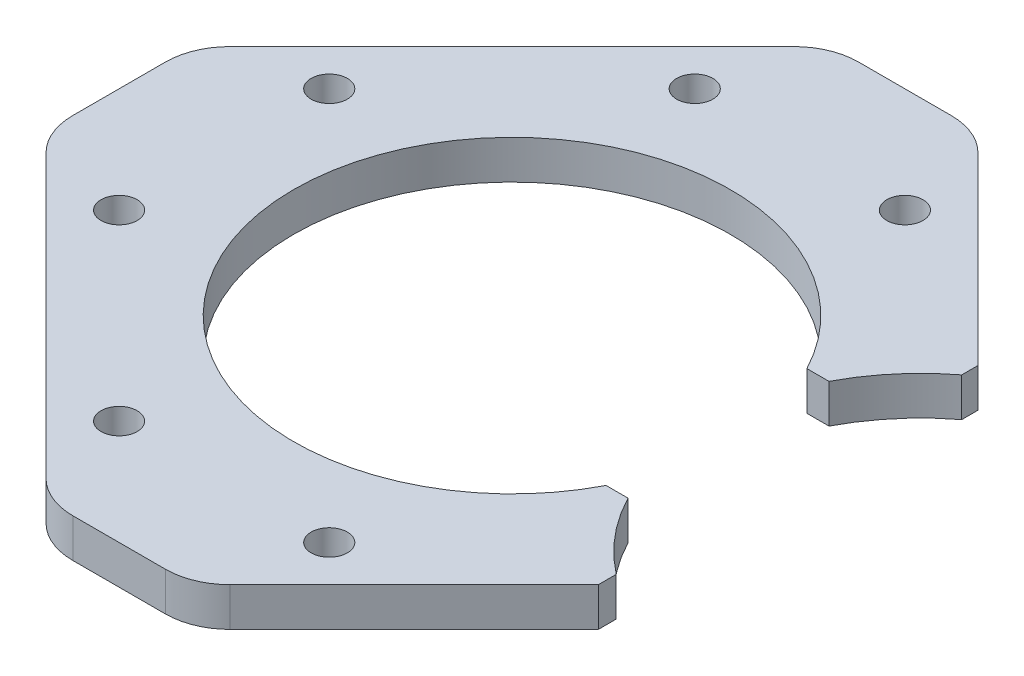
ISO-10303-21;
HEADER;
FILE_DESCRIPTION(('STEP AP214'),'2;1');
FILE_NAME('part.step','',(''),(''),'','','');
FILE_SCHEMA(('AUTOMOTIVE_DESIGN { 1 0 10303 214 1 1 1 1 }'));
ENDSEC;
DATA;
#1=APPLICATION_CONTEXT('core data for automotive mechanical design processes');
#2=APPLICATION_PROTOCOL_DEFINITION('international standard','automotive_design',2000,#1);
#3=PRODUCT_CONTEXT('',#1,'mechanical');
#4=PRODUCT('Part','Part','',(#3));
#5=PRODUCT_RELATED_PRODUCT_CATEGORY('part','',(#4));
#6=PRODUCT_DEFINITION_FORMATION('','',#4);
#7=PRODUCT_DEFINITION_CONTEXT('part definition',#1,'design');
#8=PRODUCT_DEFINITION('design','',#6,#7);
#9=PRODUCT_DEFINITION_SHAPE('','',#8);
#10=(LENGTH_UNIT() NAMED_UNIT(*) SI_UNIT(.MILLI.,.METRE.));
#11=(NAMED_UNIT(*) PLANE_ANGLE_UNIT() SI_UNIT($,.RADIAN.));
#12=(NAMED_UNIT(*) SI_UNIT($,.STERADIAN.) SOLID_ANGLE_UNIT());
#13=UNCERTAINTY_MEASURE_WITH_UNIT(LENGTH_MEASURE(1.E-05),#10,'distance_accuracy_value','');
#14=(GEOMETRIC_REPRESENTATION_CONTEXT(3) GLOBAL_UNCERTAINTY_ASSIGNED_CONTEXT((#13)) GLOBAL_UNIT_ASSIGNED_CONTEXT((#10,
#11,#12)) REPRESENTATION_CONTEXT('',''));
#15=CARTESIAN_POINT('',(0.,0.,0.));
#16=DIRECTION('',(0.,0.,1.));
#17=DIRECTION('',(1.,0.,0.));
#18=AXIS2_PLACEMENT_3D('',#15,#16,#17);
#19=CARTESIAN_POINT('',(36.,3.,0.));
#20=DIRECTION('',(0.,1.,0.));
#21=DIRECTION('',(0.,0.,1.));
#22=AXIS2_PLACEMENT_3D('',#19,#20,#21);
#23=PLANE('',#22);
#24=CARTESIAN_POINT('',(-3.76156065362437,3.,-22.2738636073764));
#25=DIRECTION('',(0.,1.,0.));
#26=DIRECTION('',(0.,0.,1.));
#27=AXIS2_PLACEMENT_3D('',#24,#25,#26);
#28=CIRCLE('',#27,1.4);
#29=CARTESIAN_POINT('',(-3.76156065362437,3.,-20.8738636073764));
#30=VERTEX_POINT('',#29);
#31=EDGE_CURVE('E488',#30,#30,#28,.T.);
#32=ORIENTED_EDGE('',*,*,#31,.F.);
#33=EDGE_LOOP('',(#32));
#34=FACE_BOUND('',#33,.T.);
#35=CARTESIAN_POINT('',(-17.9036962773556,3.,8.13172798364494));
#36=DIRECTION('',(0.,1.,0.));
#37=DIRECTION('',(0.,0.,1.));
#38=AXIS2_PLACEMENT_3D('',#35,#36,#37);
#39=CIRCLE('',#38,1.4);
#40=CARTESIAN_POINT('',(-17.9036962773556,3.,9.53172798364494));
#41=VERTEX_POINT('',#40);
#42=EDGE_CURVE('E243',#41,#41,#39,.T.);
#43=ORIENTED_EDGE('',*,*,#42,.F.);
#44=EDGE_LOOP('',(#43));
#45=FACE_BOUND('',#44,.T.);
#46=CARTESIAN_POINT('',(12.5018953136657,3.,22.2738636073764));
#47=DIRECTION('',(0.,1.,0.));
#48=DIRECTION('',(0.,0.,1.));
#49=AXIS2_PLACEMENT_3D('',#46,#47,#48);
#50=CIRCLE('',#49,1.4);
#51=CARTESIAN_POINT('',(12.5018953136657,3.,23.6738636073764));
#52=VERTEX_POINT('',#51);
#53=EDGE_CURVE('E244',#52,#52,#50,.T.);
#54=ORIENTED_EDGE('',*,*,#53,.F.);
#55=EDGE_LOOP('',(#54));
#56=FACE_BOUND('',#55,.T.);
#57=CARTESIAN_POINT('',(36.,3.,0.));
#58=DIRECTION('',(0.,-1.,0.));
#59=DIRECTION('',(0.,0.,1.));
#60=AXIS2_PLACEMENT_3D('',#57,#58,#59);
#61=CIRCLE('',#60,16.9);
#62=CARTESIAN_POINT('',(21.0390641269301,3.,-7.86005075059257));
#63=VERTEX_POINT('',#62);
#64=CARTESIAN_POINT('',(25.7425310421869,3.,-13.4310956581919));
#65=VERTEX_POINT('',#64);
#66=EDGE_CURVE('E258',#63,#65,#61,.T.);
#67=ORIENTED_EDGE('',*,*,#66,.T.);
#68=DIRECTION('',(0.,0.,-1.));
#69=VECTOR('',#68,1.);
#70=CARTESIAN_POINT('',(25.7425310421869,3.,-14.6900821283476));
#71=LINE('',#70,#69);
#72=CARTESIAN_POINT('',(25.7425310421869,3.,-14.6900821283476));
#73=VERTEX_POINT('',#72);
#74=EDGE_CURVE('E143',#65,#73,#71,.T.);
#75=ORIENTED_EDGE('',*,*,#74,.T.);
#76=DIRECTION('',(-0.707106781186536,0.,-0.707106781186559));
#77=VECTOR('',#76,1.);
#78=CARTESIAN_POINT('',(25.7425310421869,3.,-14.6900821283476));
#79=LINE('',#78,#77);
#80=CARTESIAN_POINT('',(11.4914876735808,3.,-28.9411254969542));
#81=VERTEX_POINT('',#80);
#82=EDGE_CURVE('E264',#73,#81,#79,.T.);
#83=ORIENTED_EDGE('',*,*,#82,.T.);
#84=CARTESIAN_POINT('',(7.95595376764797,3.,-25.4055915910215));
#85=DIRECTION('',(0.,1.,0.));
#86=DIRECTION('',(0.,0.,1.));
#87=AXIS2_PLACEMENT_3D('',#84,#85,#86);
#88=CIRCLE('',#87,5.00000000000002);
#89=CARTESIAN_POINT('',(7.95595376764804,3.,-30.4055915910215));
#90=VERTEX_POINT('',#89);
#91=EDGE_CURVE('E268',#81,#90,#88,.T.);
#92=ORIENTED_EDGE('',*,*,#91,.T.);
#93=DIRECTION('',(-1.,0.,0.));
#94=VECTOR('',#93,1.);
#95=CARTESIAN_POINT('',(7.95595376764804,3.,-30.4055915910214));
#96=LINE('',#95,#94);
#97=CARTESIAN_POINT('',(0.784380892394076,3.,-30.4055915910215));
#98=VERTEX_POINT('',#97);
#99=EDGE_CURVE('E276',#90,#98,#96,.T.);
#100=ORIENTED_EDGE('',*,*,#99,.T.);
#101=CARTESIAN_POINT('',(0.784380892394016,3.,-25.4055915910216));
#102=DIRECTION('',(0.,1.,0.));
#103=DIRECTION('',(0.,0.,1.));
#104=AXIS2_PLACEMENT_3D('',#101,#102,#103);
#105=CIRCLE('',#104,5.00000000000002);
#106=CARTESIAN_POINT('',(-2.75115301353867,3.,-28.9411254969544));
#107=VERTEX_POINT('',#106);
#108=EDGE_CURVE('E279',#98,#107,#105,.T.);
#109=ORIENTED_EDGE('',*,*,#108,.T.);
#110=DIRECTION('',(-0.707106781186548,0.,0.707106781186548));
#111=VECTOR('',#110,1.);
#112=CARTESIAN_POINT('',(-2.75115301353868,3.,-28.9411254969544));
#113=LINE('',#112,#111);
#114=CARTESIAN_POINT('',(-24.5709581669333,3.,-7.12132034355974));
#115=VERTEX_POINT('',#114);
#116=EDGE_CURVE('E283',#107,#115,#113,.T.);
#117=ORIENTED_EDGE('',*,*,#116,.T.);
#118=CARTESIAN_POINT('',(-21.0354242610009,3.,-3.58578643762727));
#119=DIRECTION('',(0.,1.,0.));
#120=DIRECTION('',(0.,0.,1.));
#121=AXIS2_PLACEMENT_3D('',#118,#119,#120);
#122=CIRCLE('',#121,4.99999999999981);
#123=CARTESIAN_POINT('',(-26.0354242610007,3.,-3.58578643762734));
#124=VERTEX_POINT('',#123);
#125=EDGE_CURVE('E287',#115,#124,#122,.T.);
#126=ORIENTED_EDGE('',*,*,#125,.T.);
#127=DIRECTION('',(0.,0.,1.));
#128=VECTOR('',#127,1.);
#129=CARTESIAN_POINT('',(-26.0354242610009,3.,-3.58578643762734));
#130=LINE('',#129,#128);
#131=CARTESIAN_POINT('',(-26.035424261001,3.,3.58578643762645));
#132=VERTEX_POINT('',#131);
#133=EDGE_CURVE('E295',#124,#132,#130,.T.);
#134=ORIENTED_EDGE('',*,*,#133,.T.);
#135=CARTESIAN_POINT('',(-21.035424261001,3.,3.58578643762653));
#136=DIRECTION('',(0.,1.,0.));
#137=DIRECTION('',(0.,0.,1.));
#138=AXIS2_PLACEMENT_3D('',#135,#136,#137);
#139=CIRCLE('',#138,4.99999999999998);
#140=CARTESIAN_POINT('',(-24.5709581669337,3.,7.12132034355923));
#141=VERTEX_POINT('',#140);
#142=EDGE_CURVE('E298',#132,#141,#139,.T.);
#143=ORIENTED_EDGE('',*,*,#142,.T.);
#144=DIRECTION('',(0.707106781186548,0.,0.707106781186547));
#145=VECTOR('',#144,1.);
#146=CARTESIAN_POINT('',(-24.5709581669337,3.,7.12132034355921));
#147=LINE('',#146,#145);
#148=CARTESIAN_POINT('',(-2.75115301353892,3.,28.941125496954));
#149=VERTEX_POINT('',#148);
#150=EDGE_CURVE('E302',#141,#149,#147,.T.);
#151=ORIENTED_EDGE('',*,*,#150,.T.);
#152=CARTESIAN_POINT('',(0.784380892393515,3.,25.4055915910216));
#153=DIRECTION('',(0.,1.,0.));
#154=DIRECTION('',(0.,0.,1.));
#155=AXIS2_PLACEMENT_3D('',#152,#153,#154);
#156=CIRCLE('',#155,4.99999999999979);
#157=CARTESIAN_POINT('',(0.784380892393515,3.,30.4055915910213));
#158=VERTEX_POINT('',#157);
#159=EDGE_CURVE('E306',#149,#158,#156,.T.);
#160=ORIENTED_EDGE('',*,*,#159,.T.);
#161=DIRECTION('',(1.,0.,0.));
#162=VECTOR('',#161,1.);
#163=CARTESIAN_POINT('',(0.784380892393435,3.,30.4055915910215));
#164=LINE('',#163,#162);
#165=CARTESIAN_POINT('',(7.95595376764716,3.,30.4055915910215));
#166=VERTEX_POINT('',#165);
#167=EDGE_CURVE('E314',#158,#166,#164,.T.);
#168=ORIENTED_EDGE('',*,*,#167,.T.);
#169=CARTESIAN_POINT('',(7.95595376764724,3.,25.4055915910216));
#170=DIRECTION('',(0.,1.,0.));
#171=DIRECTION('',(0.,0.,1.));
#172=AXIS2_PLACEMENT_3D('',#169,#170,#171);
#173=CIRCLE('',#172,5.00000000000002);
#174=CARTESIAN_POINT('',(11.4914876735799,3.,28.9411254969544));
#175=VERTEX_POINT('',#174);
#176=EDGE_CURVE('E317',#166,#175,#173,.T.);
#177=ORIENTED_EDGE('',*,*,#176,.T.);
#178=DIRECTION('',(0.707106781186557,0.,-0.707106781186538));
#179=VECTOR('',#178,1.);
#180=CARTESIAN_POINT('',(11.4914876735799,3.,28.9411254969544));
#181=LINE('',#180,#179);
#182=CARTESIAN_POINT('',(25.7425310421871,3.,14.6900821283476));
#183=VERTEX_POINT('',#182);
#184=EDGE_CURVE('E321',#175,#183,#181,.T.);
#185=ORIENTED_EDGE('',*,*,#184,.T.);
#186=DIRECTION('',(-1.30257714467279E-13,0.,-1.));
#187=VECTOR('',#186,1.);
#188=CARTESIAN_POINT('',(25.7425310421871,3.,14.6900821283476));
#189=LINE('',#188,#187);
#190=CARTESIAN_POINT('',(25.7425310421869,3.,13.3050490634007));
#191=VERTEX_POINT('',#190);
#192=EDGE_CURVE('E325',#183,#191,#189,.T.);
#193=ORIENTED_EDGE('',*,*,#192,.T.);
#194=CARTESIAN_POINT('',(36.,3.,0.));
#195=DIRECTION('',(0.,-1.,0.));
#196=DIRECTION('',(0.,0.,1.));
#197=AXIS2_PLACEMENT_3D('',#194,#195,#196);
#198=CIRCLE('',#197,16.8);
#199=CARTESIAN_POINT('',(21.0903668558269,3.,7.74227611921559));
#200=VERTEX_POINT('',#199);
#201=EDGE_CURVE('E198',#191,#200,#198,.T.);
#202=ORIENTED_EDGE('',*,*,#201,.T.);
#203=DIRECTION('',(-1.,0.,0.));
#204=VECTOR('',#203,1.);
#205=CARTESIAN_POINT('',(19.3923895522432,3.,7.74227611921559));
#206=LINE('',#205,#204);
#207=CARTESIAN_POINT('',(19.3923895522432,3.,7.74227611921559));
#208=VERTEX_POINT('',#207);
#209=EDGE_CURVE('E192',#200,#208,#206,.T.);
#210=ORIENTED_EDGE('',*,*,#209,.T.);
#211=CARTESIAN_POINT('',(4.37016733002108,3.,0.));
#212=DIRECTION('',(0.,-1.,0.));
#213=DIRECTION('',(0.,0.,1.));
#214=AXIS2_PLACEMENT_3D('',#211,#212,#213);
#215=CIRCLE('',#214,16.9);
#216=CARTESIAN_POINT('',(19.331103203091,3.,-7.86005075059257));
#217=VERTEX_POINT('',#216);
#218=EDGE_CURVE('E196',#208,#217,#215,.T.);
#219=ORIENTED_EDGE('',*,*,#218,.T.);
#220=DIRECTION('',(1.,0.,0.));
#221=VECTOR('',#220,1.);
#222=CARTESIAN_POINT('',(19.331103203091,3.,-7.86005075059257));
#223=LINE('',#222,#221);
#224=EDGE_CURVE('E64',#217,#63,#223,.T.);
#225=ORIENTED_EDGE('',*,*,#224,.T.);
#226=EDGE_LOOP('',(#67,#75,#83,#92,#100,#109,#117,#126,#134,#143,#151,#160,#168,#177,#185,#193,
#202,#210,#219,#225));
#227=FACE_BOUND('',#226,.T.);
#228=CARTESIAN_POINT('',(-3.7615606536249,3.,22.2738636073761));
#229=DIRECTION('',(0.,1.,0.));
#230=DIRECTION('',(0.,0.,1.));
#231=AXIS2_PLACEMENT_3D('',#228,#229,#230);
#232=CIRCLE('',#231,1.4);
#233=CARTESIAN_POINT('',(-3.7615606536249,3.,23.6738636073761));
#234=VERTEX_POINT('',#233);
#235=EDGE_CURVE('E230',#234,#234,#232,.T.);
#236=ORIENTED_EDGE('',*,*,#235,.F.);
#237=EDGE_LOOP('',(#236));
#238=FACE_BOUND('',#237,.T.);
#239=CARTESIAN_POINT('',(-17.9036962773555,3.,-8.1317279836456));
#240=DIRECTION('',(0.,1.,0.));
#241=DIRECTION('',(0.,0.,1.));
#242=AXIS2_PLACEMENT_3D('',#239,#240,#241);
#243=CIRCLE('',#242,1.4);
#244=CARTESIAN_POINT('',(-17.9036962773555,3.,-6.73172798364561));
#245=VERTEX_POINT('',#244);
#246=EDGE_CURVE('E482',#245,#245,#243,.T.);
#247=ORIENTED_EDGE('',*,*,#246,.F.);
#248=EDGE_LOOP('',(#247));
#249=FACE_BOUND('',#248,.T.);
#250=CARTESIAN_POINT('',(12.5018953136662,3.,-22.273863607376));
#251=DIRECTION('',(0.,1.,0.));
#252=DIRECTION('',(0.,0.,1.));
#253=AXIS2_PLACEMENT_3D('',#250,#251,#252);
#254=CIRCLE('',#253,1.4);
#255=CARTESIAN_POINT('',(12.5018953136662,3.,-20.873863607376));
#256=VERTEX_POINT('',#255);
#257=EDGE_CURVE('E496',#256,#256,#254,.T.);
#258=ORIENTED_EDGE('',*,*,#257,.F.);
#259=EDGE_LOOP('',(#258));
#260=FACE_BOUND('',#259,.T.);
#261=ADVANCED_FACE('F46',(#34,#45,#56,#227,#238,#249,#260),#23,.T.);
#262=CARTESIAN_POINT('',(36.,0.,0.));
#263=DIRECTION('',(0.,1.,0.));
#264=DIRECTION('',(0.,0.,1.));
#265=AXIS2_PLACEMENT_3D('',#262,#263,#264);
#266=PLANE('',#265);
#267=CARTESIAN_POINT('',(36.,0.,0.));
#268=DIRECTION('',(0.,-1.,0.));
#269=DIRECTION('',(0.,0.,1.));
#270=AXIS2_PLACEMENT_3D('',#267,#268,#269);
#271=CIRCLE('',#270,16.9);
#272=CARTESIAN_POINT('',(21.0390641269301,0.,-7.86005075059257));
#273=VERTEX_POINT('',#272);
#274=CARTESIAN_POINT('',(25.7425310421869,0.,-13.4310956581919));
#275=VERTEX_POINT('',#274);
#276=EDGE_CURVE('E249',#273,#275,#271,.T.);
#277=ORIENTED_EDGE('',*,*,#276,.F.);
#278=DIRECTION('',(1.,0.,0.));
#279=VECTOR('',#278,1.);
#280=CARTESIAN_POINT('',(19.331103203091,0.,-7.86005075059257));
#281=LINE('',#280,#279);
#282=CARTESIAN_POINT('',(19.331103203091,0.,-7.86005075059257));
#283=VERTEX_POINT('',#282);
#284=EDGE_CURVE('E135',#283,#273,#281,.T.);
#285=ORIENTED_EDGE('',*,*,#284,.F.);
#286=CARTESIAN_POINT('',(4.37016733002108,0.,0.));
#287=DIRECTION('',(0.,-1.,0.));
#288=DIRECTION('',(0.,0.,1.));
#289=AXIS2_PLACEMENT_3D('',#286,#287,#288);
#290=CIRCLE('',#289,16.9);
#291=CARTESIAN_POINT('',(19.3923895522432,0.,7.74227611921559));
#292=VERTEX_POINT('',#291);
#293=EDGE_CURVE('E129',#292,#283,#290,.T.);
#294=ORIENTED_EDGE('',*,*,#293,.F.);
#295=DIRECTION('',(-1.,0.,0.));
#296=VECTOR('',#295,1.);
#297=CARTESIAN_POINT('',(19.3923895522432,0.,7.74227611921559));
#298=LINE('',#297,#296);
#299=CARTESIAN_POINT('',(21.0903668558269,0.,7.74227611921559));
#300=VERTEX_POINT('',#299);
#301=EDGE_CURVE('E207',#300,#292,#298,.T.);
#302=ORIENTED_EDGE('',*,*,#301,.F.);
#303=CARTESIAN_POINT('',(36.,0.,0.));
#304=DIRECTION('',(0.,-1.,0.));
#305=DIRECTION('',(0.,0.,1.));
#306=AXIS2_PLACEMENT_3D('',#303,#304,#305);
#307=CIRCLE('',#306,16.8);
#308=CARTESIAN_POINT('',(25.7425310421869,0.,13.3050490634007));
#309=VERTEX_POINT('',#308);
#310=EDGE_CURVE('E348',#309,#300,#307,.T.);
#311=ORIENTED_EDGE('',*,*,#310,.F.);
#312=DIRECTION('',(-1.30257714467279E-13,0.,-1.));
#313=VECTOR('',#312,1.);
#314=CARTESIAN_POINT('',(25.7425310421871,0.,14.6900821283476));
#315=LINE('',#314,#313);
#316=CARTESIAN_POINT('',(25.7425310421871,0.,14.6900821283476));
#317=VERTEX_POINT('',#316);
#318=EDGE_CURVE('E341',#317,#309,#315,.T.);
#319=ORIENTED_EDGE('',*,*,#318,.F.);
#320=DIRECTION('',(0.707106781186557,0.,-0.707106781186538));
#321=VECTOR('',#320,1.);
#322=CARTESIAN_POINT('',(11.4914876735799,0.,28.9411254969544));
#323=LINE('',#322,#321);
#324=CARTESIAN_POINT('',(11.4914876735799,0.,28.9411254969544));
#325=VERTEX_POINT('',#324);
#326=EDGE_CURVE('E455',#325,#317,#323,.T.);
#327=ORIENTED_EDGE('',*,*,#326,.F.);
#328=CARTESIAN_POINT('',(7.95595376764724,0.,25.4055915910216));
#329=DIRECTION('',(0.,1.,0.));
#330=DIRECTION('',(0.,0.,1.));
#331=AXIS2_PLACEMENT_3D('',#328,#329,#330);
#332=CIRCLE('',#331,5.00000000000002);
#333=CARTESIAN_POINT('',(7.95595376764716,0.,30.4055915910215));
#334=VERTEX_POINT('',#333);
#335=EDGE_CURVE('E452',#334,#325,#332,.T.);
#336=ORIENTED_EDGE('',*,*,#335,.F.);
#337=DIRECTION('',(1.,0.,0.));
#338=VECTOR('',#337,1.);
#339=CARTESIAN_POINT('',(0.784380892393435,0.,30.4055915910215));
#340=LINE('',#339,#338);
#341=CARTESIAN_POINT('',(0.784380892393515,0.,30.4055915910213));
#342=VERTEX_POINT('',#341);
#343=EDGE_CURVE('E449',#342,#334,#340,.T.);
#344=ORIENTED_EDGE('',*,*,#343,.F.);
#345=CARTESIAN_POINT('',(0.784380892393515,0.,25.4055915910216));
#346=DIRECTION('',(0.,1.,0.));
#347=DIRECTION('',(0.,0.,1.));
#348=AXIS2_PLACEMENT_3D('',#345,#346,#347);
#349=CIRCLE('',#348,4.99999999999979);
#350=CARTESIAN_POINT('',(-2.75115301353892,0.,28.941125496954));
#351=VERTEX_POINT('',#350);
#352=EDGE_CURVE('E446',#351,#342,#349,.T.);
#353=ORIENTED_EDGE('',*,*,#352,.F.);
#354=DIRECTION('',(0.707106781186548,0.,0.707106781186547));
#355=VECTOR('',#354,1.);
#356=CARTESIAN_POINT('',(-24.5709581669337,0.,7.12132034355921));
#357=LINE('',#356,#355);
#358=CARTESIAN_POINT('',(-24.5709581669337,0.,7.12132034355923));
#359=VERTEX_POINT('',#358);
#360=EDGE_CURVE('E443',#359,#351,#357,.T.);
#361=ORIENTED_EDGE('',*,*,#360,.F.);
#362=CARTESIAN_POINT('',(-21.035424261001,0.,3.58578643762653));
#363=DIRECTION('',(0.,1.,0.));
#364=DIRECTION('',(0.,0.,1.));
#365=AXIS2_PLACEMENT_3D('',#362,#363,#364);
#366=CIRCLE('',#365,4.99999999999998);
#367=CARTESIAN_POINT('',(-26.035424261001,0.,3.58578643762645));
#368=VERTEX_POINT('',#367);
#369=EDGE_CURVE('E440',#368,#359,#366,.T.);
#370=ORIENTED_EDGE('',*,*,#369,.F.);
#371=DIRECTION('',(0.,0.,1.));
#372=VECTOR('',#371,1.);
#373=CARTESIAN_POINT('',(-26.0354242610009,0.,-3.58578643762734));
#374=LINE('',#373,#372);
#375=CARTESIAN_POINT('',(-26.0354242610007,0.,-3.58578643762734));
#376=VERTEX_POINT('',#375);
#377=EDGE_CURVE('E437',#376,#368,#374,.T.);
#378=ORIENTED_EDGE('',*,*,#377,.F.);
#379=CARTESIAN_POINT('',(-21.0354242610009,0.,-3.58578643762727));
#380=DIRECTION('',(0.,1.,0.));
#381=DIRECTION('',(0.,0.,1.));
#382=AXIS2_PLACEMENT_3D('',#379,#380,#381);
#383=CIRCLE('',#382,4.99999999999981);
#384=CARTESIAN_POINT('',(-24.5709581669333,0.,-7.12132034355974));
#385=VERTEX_POINT('',#384);
#386=EDGE_CURVE('E434',#385,#376,#383,.T.);
#387=ORIENTED_EDGE('',*,*,#386,.F.);
#388=DIRECTION('',(-0.707106781186548,0.,0.707106781186548));
#389=VECTOR('',#388,1.);
#390=CARTESIAN_POINT('',(-2.75115301353868,0.,-28.9411254969544));
#391=LINE('',#390,#389);
#392=CARTESIAN_POINT('',(-2.75115301353867,0.,-28.9411254969544));
#393=VERTEX_POINT('',#392);
#394=EDGE_CURVE('E431',#393,#385,#391,.T.);
#395=ORIENTED_EDGE('',*,*,#394,.F.);
#396=CARTESIAN_POINT('',(0.784380892394016,0.,-25.4055915910216));
#397=DIRECTION('',(0.,1.,0.));
#398=DIRECTION('',(0.,0.,1.));
#399=AXIS2_PLACEMENT_3D('',#396,#397,#398);
#400=CIRCLE('',#399,5.00000000000002);
#401=CARTESIAN_POINT('',(0.784380892394076,0.,-30.4055915910215));
#402=VERTEX_POINT('',#401);
#403=EDGE_CURVE('E428',#402,#393,#400,.T.);
#404=ORIENTED_EDGE('',*,*,#403,.F.);
#405=DIRECTION('',(-1.,0.,0.));
#406=VECTOR('',#405,1.);
#407=CARTESIAN_POINT('',(7.95595376764804,0.,-30.4055915910214));
#408=LINE('',#407,#406);
#409=CARTESIAN_POINT('',(7.95595376764804,0.,-30.4055915910215));
#410=VERTEX_POINT('',#409);
#411=EDGE_CURVE('E422',#410,#402,#408,.T.);
#412=ORIENTED_EDGE('',*,*,#411,.F.);
#413=CARTESIAN_POINT('',(7.95595376764797,0.,-25.4055915910215));
#414=DIRECTION('',(0.,1.,0.));
#415=DIRECTION('',(0.,0.,1.));
#416=AXIS2_PLACEMENT_3D('',#413,#414,#415);
#417=CIRCLE('',#416,5.00000000000002);
#418=CARTESIAN_POINT('',(11.4914876735808,0.,-28.9411254969542));
#419=VERTEX_POINT('',#418);
#420=EDGE_CURVE('E417',#419,#410,#417,.T.);
#421=ORIENTED_EDGE('',*,*,#420,.F.);
#422=DIRECTION('',(-0.707106781186536,0.,-0.707106781186559));
#423=VECTOR('',#422,1.);
#424=CARTESIAN_POINT('',(25.7425310421869,0.,-14.6900821283476));
#425=LINE('',#424,#423);
#426=CARTESIAN_POINT('',(25.7425310421869,0.,-14.6900821283476));
#427=VERTEX_POINT('',#426);
#428=EDGE_CURVE('E409',#427,#419,#425,.T.);
#429=ORIENTED_EDGE('',*,*,#428,.F.);
#430=DIRECTION('',(0.,0.,-1.));
#431=VECTOR('',#430,1.);
#432=CARTESIAN_POINT('',(25.7425310421869,0.,-14.6900821283476));
#433=LINE('',#432,#431);
#434=EDGE_CURVE('E415',#275,#427,#433,.T.);
#435=ORIENTED_EDGE('',*,*,#434,.F.);
#436=EDGE_LOOP('',(#277,#285,#294,#302,#311,#319,#327,#336,#344,#353,#361,#370,#378,#387,#395,
#404,#412,#421,#429,#435));
#437=FACE_BOUND('',#436,.T.);
#438=CARTESIAN_POINT('',(12.5018953136657,0.,22.2738636073764));
#439=DIRECTION('',(0.,1.,0.));
#440=DIRECTION('',(0.,0.,1.));
#441=AXIS2_PLACEMENT_3D('',#438,#439,#440);
#442=CIRCLE('',#441,1.4);
#443=CARTESIAN_POINT('',(12.5018953136657,0.,23.6738636073764));
#444=VERTEX_POINT('',#443);
#445=EDGE_CURVE('E236',#444,#444,#442,.T.);
#446=ORIENTED_EDGE('',*,*,#445,.T.);
#447=EDGE_LOOP('',(#446));
#448=FACE_BOUND('',#447,.T.);
#449=CARTESIAN_POINT('',(-3.7615606536249,0.,22.2738636073761));
#450=DIRECTION('',(0.,1.,0.));
#451=DIRECTION('',(0.,0.,1.));
#452=AXIS2_PLACEMENT_3D('',#449,#450,#451);
#453=CIRCLE('',#452,1.4);
#454=CARTESIAN_POINT('',(-3.7615606536249,0.,23.6738636073761));
#455=VERTEX_POINT('',#454);
#456=EDGE_CURVE('E237',#455,#455,#453,.T.);
#457=ORIENTED_EDGE('',*,*,#456,.T.);
#458=EDGE_LOOP('',(#457));
#459=FACE_BOUND('',#458,.T.);
#460=CARTESIAN_POINT('',(-17.9036962773556,0.,8.13172798364494));
#461=DIRECTION('',(0.,1.,0.));
#462=DIRECTION('',(0.,0.,1.));
#463=AXIS2_PLACEMENT_3D('',#460,#461,#462);
#464=CIRCLE('',#463,1.4);
#465=CARTESIAN_POINT('',(-17.9036962773556,0.,9.53172798364494));
#466=VERTEX_POINT('',#465);
#467=EDGE_CURVE('E238',#466,#466,#464,.T.);
#468=ORIENTED_EDGE('',*,*,#467,.T.);
#469=EDGE_LOOP('',(#468));
#470=FACE_BOUND('',#469,.T.);
#471=CARTESIAN_POINT('',(-17.9036962773555,0.,-8.1317279836456));
#472=DIRECTION('',(0.,1.,0.));
#473=DIRECTION('',(0.,0.,1.));
#474=AXIS2_PLACEMENT_3D('',#471,#472,#473);
#475=CIRCLE('',#474,1.4);
#476=CARTESIAN_POINT('',(-17.9036962773555,0.,-6.73172798364561));
#477=VERTEX_POINT('',#476);
#478=EDGE_CURVE('E485',#477,#477,#475,.T.);
#479=ORIENTED_EDGE('',*,*,#478,.T.);
#480=EDGE_LOOP('',(#479));
#481=FACE_BOUND('',#480,.T.);
#482=CARTESIAN_POINT('',(-3.76156065362437,0.,-22.2738636073764));
#483=DIRECTION('',(0.,1.,0.));
#484=DIRECTION('',(0.,0.,1.));
#485=AXIS2_PLACEMENT_3D('',#482,#483,#484);
#486=CIRCLE('',#485,1.4);
#487=CARTESIAN_POINT('',(-3.76156065362437,0.,-20.8738636073764));
#488=VERTEX_POINT('',#487);
#489=EDGE_CURVE('E492',#488,#488,#486,.T.);
#490=ORIENTED_EDGE('',*,*,#489,.T.);
#491=EDGE_LOOP('',(#490));
#492=FACE_BOUND('',#491,.T.);
#493=CARTESIAN_POINT('',(12.5018953136662,0.,-22.273863607376));
#494=DIRECTION('',(0.,1.,0.));
#495=DIRECTION('',(0.,0.,1.));
#496=AXIS2_PLACEMENT_3D('',#493,#494,#495);
#497=CIRCLE('',#496,1.4);
#498=CARTESIAN_POINT('',(12.5018953136662,0.,-20.873863607376));
#499=VERTEX_POINT('',#498);
#500=EDGE_CURVE('E500',#499,#499,#497,.T.);
#501=ORIENTED_EDGE('',*,*,#500,.T.);
#502=EDGE_LOOP('',(#501));
#503=FACE_BOUND('',#502,.T.);
#504=ADVANCED_FACE('F413',(#437,#448,#459,#470,#481,#492,#503),#266,.F.);
#505=CARTESIAN_POINT('',(36.,3.,0.));
#506=DIRECTION('',(0.,-1.,0.));
#507=DIRECTION('',(0.,0.,-1.));
#508=AXIS2_PLACEMENT_3D('',#505,#506,#507);
#509=CYLINDRICAL_SURFACE('',#508,16.9);
#510=ORIENTED_EDGE('',*,*,#276,.T.);
#511=DIRECTION('',(0.,-1.,0.));
#512=VECTOR('',#511,1.);
#513=CARTESIAN_POINT('',(25.7425310421869,3.,-13.4310956581919));
#514=LINE('',#513,#512);
#515=EDGE_CURVE('E12',#65,#275,#514,.T.);
#516=ORIENTED_EDGE('',*,*,#515,.F.);
#517=ORIENTED_EDGE('',*,*,#66,.F.);
#518=DIRECTION('',(0.,-1.,0.));
#519=VECTOR('',#518,1.);
#520=CARTESIAN_POINT('',(21.0390641269301,3.,-7.86005075059257));
#521=LINE('',#520,#519);
#522=EDGE_CURVE('E216',#63,#273,#521,.T.);
#523=ORIENTED_EDGE('',*,*,#522,.T.);
#524=EDGE_LOOP('',(#510,#516,#517,#523));
#525=FACE_BOUND('',#524,.T.);
#526=ADVANCED_FACE('F48',(#525),#509,.F.);
#527=CARTESIAN_POINT('',(25.7425310421869,3.,-14.6900821283476));
#528=DIRECTION('',(-1.,0.,0.));
#529=DIRECTION('',(0.,0.,1.));
#530=AXIS2_PLACEMENT_3D('',#527,#528,#529);
#531=PLANE('',#530);
#532=ORIENTED_EDGE('',*,*,#434,.T.);
#533=DIRECTION('',(0.,-1.,0.));
#534=VECTOR('',#533,1.);
#535=CARTESIAN_POINT('',(25.7425310421869,3.,-14.6900821283476));
#536=LINE('',#535,#534);
#537=EDGE_CURVE('E56',#73,#427,#536,.T.);
#538=ORIENTED_EDGE('',*,*,#537,.F.);
#539=ORIENTED_EDGE('',*,*,#74,.F.);
#540=ORIENTED_EDGE('',*,*,#515,.T.);
#541=EDGE_LOOP('',(#532,#538,#539,#540));
#542=FACE_BOUND('',#541,.T.);
#543=ADVANCED_FACE('F593',(#542),#531,.F.);
#544=CARTESIAN_POINT('',(25.7425310421869,3.,-14.6900821283476));
#545=DIRECTION('',(-0.707106781186559,0.,0.707106781186536));
#546=DIRECTION('',(0.707106781186536,0.,0.707106781186559));
#547=AXIS2_PLACEMENT_3D('',#544,#545,#546);
#548=PLANE('',#547);
#549=ORIENTED_EDGE('',*,*,#428,.T.);
#550=DIRECTION('',(0.,-1.,0.));
#551=VECTOR('',#550,1.);
#552=CARTESIAN_POINT('',(11.4914876735808,3.,-28.9411254969542));
#553=LINE('',#552,#551);
#554=EDGE_CURVE('E399',#81,#419,#553,.T.);
#555=ORIENTED_EDGE('',*,*,#554,.F.);
#556=ORIENTED_EDGE('',*,*,#82,.F.);
#557=ORIENTED_EDGE('',*,*,#537,.T.);
#558=EDGE_LOOP('',(#549,#555,#556,#557));
#559=FACE_BOUND('',#558,.T.);
#560=ADVANCED_FACE('F407',(#559),#548,.F.);
#561=CARTESIAN_POINT('',(7.95595376764797,3.,-25.4055915910215));
#562=DIRECTION('',(0.,-1.,0.));
#563=DIRECTION('',(0.,0.,-1.));
#564=AXIS2_PLACEMENT_3D('',#561,#562,#563);
#565=CYLINDRICAL_SURFACE('',#564,5.00000000000002);
#566=ORIENTED_EDGE('',*,*,#420,.T.);
#567=DIRECTION('',(0.,-1.,0.));
#568=VECTOR('',#567,1.);
#569=CARTESIAN_POINT('',(7.95595376764804,3.,-30.4055915910215));
#570=LINE('',#569,#568);
#571=EDGE_CURVE('E395',#90,#410,#570,.T.);
#572=ORIENTED_EDGE('',*,*,#571,.F.);
#573=ORIENTED_EDGE('',*,*,#91,.F.);
#574=ORIENTED_EDGE('',*,*,#554,.T.);
#575=EDGE_LOOP('',(#566,#572,#573,#574));
#576=FACE_BOUND('',#575,.T.);
#577=ADVANCED_FACE('F587',(#576),#565,.T.);
#578=CARTESIAN_POINT('',(7.95595376764804,3.,-30.4055915910214));
#579=DIRECTION('',(0.,0.,1.));
#580=DIRECTION('',(1.,0.,0.));
#581=AXIS2_PLACEMENT_3D('',#578,#579,#580);
#582=PLANE('',#581);
#583=ORIENTED_EDGE('',*,*,#411,.T.);
#584=DIRECTION('',(0.,-1.,0.));
#585=VECTOR('',#584,1.);
#586=CARTESIAN_POINT('',(0.784380892394076,3.,-30.4055915910215));
#587=LINE('',#586,#585);
#588=EDGE_CURVE('E391',#98,#402,#587,.T.);
#589=ORIENTED_EDGE('',*,*,#588,.F.);
#590=ORIENTED_EDGE('',*,*,#99,.F.);
#591=ORIENTED_EDGE('',*,*,#571,.T.);
#592=EDGE_LOOP('',(#583,#589,#590,#591));
#593=FACE_BOUND('',#592,.T.);
#594=ADVANCED_FACE('F583',(#593),#582,.F.);
#595=CARTESIAN_POINT('',(0.784380892394016,3.,-25.4055915910216));
#596=DIRECTION('',(0.,-1.,0.));
#597=DIRECTION('',(0.,0.,-1.));
#598=AXIS2_PLACEMENT_3D('',#595,#596,#597);
#599=CYLINDRICAL_SURFACE('',#598,5.00000000000002);
#600=ORIENTED_EDGE('',*,*,#403,.T.);
#601=DIRECTION('',(0.,-1.,0.));
#602=VECTOR('',#601,1.);
#603=CARTESIAN_POINT('',(-2.75115301353867,3.,-28.9411254969544));
#604=LINE('',#603,#602);
#605=EDGE_CURVE('E387',#107,#393,#604,.T.);
#606=ORIENTED_EDGE('',*,*,#605,.F.);
#607=ORIENTED_EDGE('',*,*,#108,.F.);
#608=ORIENTED_EDGE('',*,*,#588,.T.);
#609=EDGE_LOOP('',(#600,#606,#607,#608));
#610=FACE_BOUND('',#609,.T.);
#611=ADVANCED_FACE('F579',(#610),#599,.T.);
#612=CARTESIAN_POINT('',(-2.75115301353868,3.,-28.9411254969544));
#613=DIRECTION('',(0.707106781186547,0.,0.707106781186547));
#614=DIRECTION('',(0.707106781186548,0.,-0.707106781186548));
#615=AXIS2_PLACEMENT_3D('',#612,#613,#614);
#616=PLANE('',#615);
#617=ORIENTED_EDGE('',*,*,#394,.T.);
#618=DIRECTION('',(0.,-1.,0.));
#619=VECTOR('',#618,1.);
#620=CARTESIAN_POINT('',(-24.5709581669333,3.,-7.12132034355974));
#621=LINE('',#620,#619);
#622=EDGE_CURVE('E383',#115,#385,#621,.T.);
#623=ORIENTED_EDGE('',*,*,#622,.F.);
#624=ORIENTED_EDGE('',*,*,#116,.F.);
#625=ORIENTED_EDGE('',*,*,#605,.T.);
#626=EDGE_LOOP('',(#617,#623,#624,#625));
#627=FACE_BOUND('',#626,.T.);
#628=ADVANCED_FACE('F575',(#627),#616,.F.);
#629=CARTESIAN_POINT('',(-21.0354242610009,3.,-3.58578643762727));
#630=DIRECTION('',(0.,-1.,0.));
#631=DIRECTION('',(0.,0.,-1.));
#632=AXIS2_PLACEMENT_3D('',#629,#630,#631);
#633=CYLINDRICAL_SURFACE('',#632,4.99999999999981);
#634=ORIENTED_EDGE('',*,*,#386,.T.);
#635=DIRECTION('',(0.,-1.,0.));
#636=VECTOR('',#635,1.);
#637=CARTESIAN_POINT('',(-26.0354242610007,3.,-3.58578643762734));
#638=LINE('',#637,#636);
#639=EDGE_CURVE('E379',#124,#376,#638,.T.);
#640=ORIENTED_EDGE('',*,*,#639,.F.);
#641=ORIENTED_EDGE('',*,*,#125,.F.);
#642=ORIENTED_EDGE('',*,*,#622,.T.);
#643=EDGE_LOOP('',(#634,#640,#641,#642));
#644=FACE_BOUND('',#643,.T.);
#645=ADVANCED_FACE('F571',(#644),#633,.T.);
#646=CARTESIAN_POINT('',(-26.0354242610009,3.,-3.58578643762734));
#647=DIRECTION('',(1.,0.,0.));
#648=DIRECTION('',(0.,0.,-1.));
#649=AXIS2_PLACEMENT_3D('',#646,#647,#648);
#650=PLANE('',#649);
#651=ORIENTED_EDGE('',*,*,#377,.T.);
#652=DIRECTION('',(0.,-1.,0.));
#653=VECTOR('',#652,1.);
#654=CARTESIAN_POINT('',(-26.035424261001,3.,3.58578643762645));
#655=LINE('',#654,#653);
#656=EDGE_CURVE('E375',#132,#368,#655,.T.);
#657=ORIENTED_EDGE('',*,*,#656,.F.);
#658=ORIENTED_EDGE('',*,*,#133,.F.);
#659=ORIENTED_EDGE('',*,*,#639,.T.);
#660=EDGE_LOOP('',(#651,#657,#658,#659));
#661=FACE_BOUND('',#660,.T.);
#662=ADVANCED_FACE('F567',(#661),#650,.F.);
#663=CARTESIAN_POINT('',(-21.035424261001,3.,3.58578643762653));
#664=DIRECTION('',(0.,-1.,0.));
#665=DIRECTION('',(0.,0.,-1.));
#666=AXIS2_PLACEMENT_3D('',#663,#664,#665);
#667=CYLINDRICAL_SURFACE('',#666,4.99999999999998);
#668=ORIENTED_EDGE('',*,*,#369,.T.);
#669=DIRECTION('',(0.,-1.,0.));
#670=VECTOR('',#669,1.);
#671=CARTESIAN_POINT('',(-24.5709581669337,3.,7.12132034355923));
#672=LINE('',#671,#670);
#673=EDGE_CURVE('E371',#141,#359,#672,.T.);
#674=ORIENTED_EDGE('',*,*,#673,.F.);
#675=ORIENTED_EDGE('',*,*,#142,.F.);
#676=ORIENTED_EDGE('',*,*,#656,.T.);
#677=EDGE_LOOP('',(#668,#674,#675,#676));
#678=FACE_BOUND('',#677,.T.);
#679=ADVANCED_FACE('F563',(#678),#667,.T.);
#680=CARTESIAN_POINT('',(-24.5709581669337,3.,7.12132034355921));
#681=DIRECTION('',(0.707106781186547,0.,-0.707106781186548));
#682=DIRECTION('',(-0.707106781186548,0.,-0.707106781186547));
#683=AXIS2_PLACEMENT_3D('',#680,#681,#682);
#684=PLANE('',#683);
#685=ORIENTED_EDGE('',*,*,#360,.T.);
#686=DIRECTION('',(0.,-1.,0.));
#687=VECTOR('',#686,1.);
#688=CARTESIAN_POINT('',(-2.75115301353892,3.,28.941125496954));
#689=LINE('',#688,#687);
#690=EDGE_CURVE('E367',#149,#351,#689,.T.);
#691=ORIENTED_EDGE('',*,*,#690,.F.);
#692=ORIENTED_EDGE('',*,*,#150,.F.);
#693=ORIENTED_EDGE('',*,*,#673,.T.);
#694=EDGE_LOOP('',(#685,#691,#692,#693));
#695=FACE_BOUND('',#694,.T.);
#696=ADVANCED_FACE('F559',(#695),#684,.F.);
#697=CARTESIAN_POINT('',(0.784380892393515,3.,25.4055915910216));
#698=DIRECTION('',(0.,-1.,0.));
#699=DIRECTION('',(0.,0.,-1.));
#700=AXIS2_PLACEMENT_3D('',#697,#698,#699);
#701=CYLINDRICAL_SURFACE('',#700,4.99999999999979);
#702=ORIENTED_EDGE('',*,*,#352,.T.);
#703=DIRECTION('',(0.,-1.,0.));
#704=VECTOR('',#703,1.);
#705=CARTESIAN_POINT('',(0.784380892393515,3.,30.4055915910213));
#706=LINE('',#705,#704);
#707=EDGE_CURVE('E363',#158,#342,#706,.T.);
#708=ORIENTED_EDGE('',*,*,#707,.F.);
#709=ORIENTED_EDGE('',*,*,#159,.F.);
#710=ORIENTED_EDGE('',*,*,#690,.T.);
#711=EDGE_LOOP('',(#702,#708,#709,#710));
#712=FACE_BOUND('',#711,.T.);
#713=ADVANCED_FACE('F555',(#712),#701,.T.);
#714=CARTESIAN_POINT('',(0.784380892393435,3.,30.4055915910215));
#715=DIRECTION('',(0.,0.,-1.));
#716=DIRECTION('',(-1.,0.,0.));
#717=AXIS2_PLACEMENT_3D('',#714,#715,#716);
#718=PLANE('',#717);
#719=ORIENTED_EDGE('',*,*,#343,.T.);
#720=DIRECTION('',(0.,-1.,0.));
#721=VECTOR('',#720,1.);
#722=CARTESIAN_POINT('',(7.95595376764716,3.,30.4055915910215));
#723=LINE('',#722,#721);
#724=EDGE_CURVE('E359',#166,#334,#723,.T.);
#725=ORIENTED_EDGE('',*,*,#724,.F.);
#726=ORIENTED_EDGE('',*,*,#167,.F.);
#727=ORIENTED_EDGE('',*,*,#707,.T.);
#728=EDGE_LOOP('',(#719,#725,#726,#727));
#729=FACE_BOUND('',#728,.T.);
#730=ADVANCED_FACE('F551',(#729),#718,.F.);
#731=CARTESIAN_POINT('',(7.95595376764724,3.,25.4055915910216));
#732=DIRECTION('',(0.,-1.,0.));
#733=DIRECTION('',(0.,0.,-1.));
#734=AXIS2_PLACEMENT_3D('',#731,#732,#733);
#735=CYLINDRICAL_SURFACE('',#734,5.00000000000002);
#736=ORIENTED_EDGE('',*,*,#335,.T.);
#737=DIRECTION('',(0.,-1.,0.));
#738=VECTOR('',#737,1.);
#739=CARTESIAN_POINT('',(11.4914876735799,3.,28.9411254969544));
#740=LINE('',#739,#738);
#741=EDGE_CURVE('E355',#175,#325,#740,.T.);
#742=ORIENTED_EDGE('',*,*,#741,.F.);
#743=ORIENTED_EDGE('',*,*,#176,.F.);
#744=ORIENTED_EDGE('',*,*,#724,.T.);
#745=EDGE_LOOP('',(#736,#742,#743,#744));
#746=FACE_BOUND('',#745,.T.);
#747=ADVANCED_FACE('F547',(#746),#735,.T.);
#748=CARTESIAN_POINT('',(11.4914876735799,3.,28.9411254969544));
#749=DIRECTION('',(-0.707106781186538,0.,-0.707106781186557));
#750=DIRECTION('',(-0.707106781186557,0.,0.707106781186538));
#751=AXIS2_PLACEMENT_3D('',#748,#749,#750);
#752=PLANE('',#751);
#753=ORIENTED_EDGE('',*,*,#326,.T.);
#754=DIRECTION('',(0.,-1.,0.));
#755=VECTOR('',#754,1.);
#756=CARTESIAN_POINT('',(25.7425310421871,3.,14.6900821283476));
#757=LINE('',#756,#755);
#758=EDGE_CURVE('E345',#183,#317,#757,.T.);
#759=ORIENTED_EDGE('',*,*,#758,.F.);
#760=ORIENTED_EDGE('',*,*,#184,.F.);
#761=ORIENTED_EDGE('',*,*,#741,.T.);
#762=EDGE_LOOP('',(#753,#759,#760,#761));
#763=FACE_BOUND('',#762,.T.);
#764=ADVANCED_FACE('F544',(#763),#752,.F.);
#765=CARTESIAN_POINT('',(25.7425310421871,3.,14.6900821283476));
#766=DIRECTION('',(-1.,0.,1.30257714467279E-13));
#767=DIRECTION('',(1.30257714467279E-13,0.,1.));
#768=AXIS2_PLACEMENT_3D('',#765,#766,#767);
#769=PLANE('',#768);
#770=ORIENTED_EDGE('',*,*,#318,.T.);
#771=DIRECTION('',(0.,-1.,0.));
#772=VECTOR('',#771,1.);
#773=CARTESIAN_POINT('',(25.7425310421869,3.,13.3050490634007));
#774=LINE('',#773,#772);
#775=EDGE_CURVE('E338',#191,#309,#774,.T.);
#776=ORIENTED_EDGE('',*,*,#775,.F.);
#777=ORIENTED_EDGE('',*,*,#192,.F.);
#778=ORIENTED_EDGE('',*,*,#758,.T.);
#779=EDGE_LOOP('',(#770,#776,#777,#778));
#780=FACE_BOUND('',#779,.T.);
#781=ADVANCED_FACE('F339',(#780),#769,.F.);
#782=CARTESIAN_POINT('',(36.,3.,0.));
#783=DIRECTION('',(0.,-1.,0.));
#784=DIRECTION('',(0.,0.,-1.));
#785=AXIS2_PLACEMENT_3D('',#782,#783,#784);
#786=CYLINDRICAL_SURFACE('',#785,16.8);
#787=ORIENTED_EDGE('',*,*,#310,.T.);
#788=DIRECTION('',(0.,-1.,0.));
#789=VECTOR('',#788,1.);
#790=CARTESIAN_POINT('',(21.0903668558269,3.,7.74227611921559));
#791=LINE('',#790,#789);
#792=EDGE_CURVE('E209',#200,#300,#791,.T.);
#793=ORIENTED_EDGE('',*,*,#792,.F.);
#794=ORIENTED_EDGE('',*,*,#201,.F.);
#795=ORIENTED_EDGE('',*,*,#775,.T.);
#796=EDGE_LOOP('',(#787,#793,#794,#795));
#797=FACE_BOUND('',#796,.T.);
#798=ADVANCED_FACE('F347',(#797),#786,.F.);
#799=CARTESIAN_POINT('',(19.3923895522432,3.,7.74227611921559));
#800=DIRECTION('',(0.,0.,1.));
#801=DIRECTION('',(1.,0.,0.));
#802=AXIS2_PLACEMENT_3D('',#799,#800,#801);
#803=PLANE('',#802);
#804=ORIENTED_EDGE('',*,*,#301,.T.);
#805=DIRECTION('',(0.,-1.,0.));
#806=VECTOR('',#805,1.);
#807=CARTESIAN_POINT('',(19.3923895522432,3.,7.74227611921559));
#808=LINE('',#807,#806);
#809=EDGE_CURVE('E204',#208,#292,#808,.T.);
#810=ORIENTED_EDGE('',*,*,#809,.F.);
#811=ORIENTED_EDGE('',*,*,#209,.F.);
#812=ORIENTED_EDGE('',*,*,#792,.T.);
#813=EDGE_LOOP('',(#804,#810,#811,#812));
#814=FACE_BOUND('',#813,.T.);
#815=ADVANCED_FACE('F205',(#814),#803,.F.);
#816=CARTESIAN_POINT('',(4.37016733002108,3.,0.));
#817=DIRECTION('',(0.,-1.,0.));
#818=DIRECTION('',(0.,0.,-1.));
#819=AXIS2_PLACEMENT_3D('',#816,#817,#818);
#820=CYLINDRICAL_SURFACE('',#819,16.9);
#821=ORIENTED_EDGE('',*,*,#293,.T.);
#822=DIRECTION('',(0.,-1.,0.));
#823=VECTOR('',#822,1.);
#824=CARTESIAN_POINT('',(19.331103203091,3.,-7.86005075059257));
#825=LINE('',#824,#823);
#826=EDGE_CURVE('E210',#217,#283,#825,.T.);
#827=ORIENTED_EDGE('',*,*,#826,.F.);
#828=ORIENTED_EDGE('',*,*,#218,.F.);
#829=ORIENTED_EDGE('',*,*,#809,.T.);
#830=EDGE_LOOP('',(#821,#827,#828,#829));
#831=FACE_BOUND('',#830,.T.);
#832=ADVANCED_FACE('F212',(#831),#820,.F.);
#833=CARTESIAN_POINT('',(19.331103203091,3.,-7.86005075059257));
#834=DIRECTION('',(0.,0.,-1.));
#835=DIRECTION('',(-1.,0.,0.));
#836=AXIS2_PLACEMENT_3D('',#833,#834,#835);
#837=PLANE('',#836);
#838=ORIENTED_EDGE('',*,*,#284,.T.);
#839=ORIENTED_EDGE('',*,*,#522,.F.);
#840=ORIENTED_EDGE('',*,*,#224,.F.);
#841=ORIENTED_EDGE('',*,*,#826,.T.);
#842=EDGE_LOOP('',(#838,#839,#840,#841));
#843=FACE_BOUND('',#842,.T.);
#844=ADVANCED_FACE('F470',(#843),#837,.F.);
#845=CARTESIAN_POINT('',(12.5018953136657,3.,22.2738636073764));
#846=DIRECTION('',(0.,-1.,0.));
#847=DIRECTION('',(0.,0.,-1.));
#848=AXIS2_PLACEMENT_3D('',#845,#846,#847);
#849=CYLINDRICAL_SURFACE('',#848,1.4);
#850=ORIENTED_EDGE('',*,*,#53,.T.);
#851=EDGE_LOOP('',(#850));
#852=FACE_BOUND('',#851,.T.);
#853=ORIENTED_EDGE('',*,*,#445,.F.);
#854=EDGE_LOOP('',(#853));
#855=FACE_BOUND('',#854,.T.);
#856=ADVANCED_FACE('F531',(#852,#855),#849,.F.);
#857=CARTESIAN_POINT('',(-3.7615606536249,3.,22.2738636073761));
#858=DIRECTION('',(0.,-1.,0.));
#859=DIRECTION('',(0.,0.,-1.));
#860=AXIS2_PLACEMENT_3D('',#857,#858,#859);
#861=CYLINDRICAL_SURFACE('',#860,1.4);
#862=ORIENTED_EDGE('',*,*,#235,.T.);
#863=EDGE_LOOP('',(#862));
#864=FACE_BOUND('',#863,.T.);
#865=ORIENTED_EDGE('',*,*,#456,.F.);
#866=EDGE_LOOP('',(#865));
#867=FACE_BOUND('',#866,.T.);
#868=ADVANCED_FACE('F749',(#864,#867),#861,.F.);
#869=CARTESIAN_POINT('',(-17.9036962773556,3.,8.13172798364494));
#870=DIRECTION('',(0.,-1.,0.));
#871=DIRECTION('',(0.,0.,-1.));
#872=AXIS2_PLACEMENT_3D('',#869,#870,#871);
#873=CYLINDRICAL_SURFACE('',#872,1.4);
#874=ORIENTED_EDGE('',*,*,#42,.T.);
#875=EDGE_LOOP('',(#874));
#876=FACE_BOUND('',#875,.T.);
#877=ORIENTED_EDGE('',*,*,#467,.F.);
#878=EDGE_LOOP('',(#877));
#879=FACE_BOUND('',#878,.T.);
#880=ADVANCED_FACE('F757',(#876,#879),#873,.F.);
#881=CARTESIAN_POINT('',(-17.9036962773555,3.,-8.1317279836456));
#882=DIRECTION('',(0.,-1.,0.));
#883=DIRECTION('',(0.,0.,-1.));
#884=AXIS2_PLACEMENT_3D('',#881,#882,#883);
#885=CYLINDRICAL_SURFACE('',#884,1.4);
#886=ORIENTED_EDGE('',*,*,#246,.T.);
#887=EDGE_LOOP('',(#886));
#888=FACE_BOUND('',#887,.T.);
#889=ORIENTED_EDGE('',*,*,#478,.F.);
#890=EDGE_LOOP('',(#889));
#891=FACE_BOUND('',#890,.T.);
#892=ADVANCED_FACE('F518',(#888,#891),#885,.F.);
#893=CARTESIAN_POINT('',(-3.76156065362437,3.,-22.2738636073764));
#894=DIRECTION('',(0.,-1.,0.));
#895=DIRECTION('',(0.,0.,-1.));
#896=AXIS2_PLACEMENT_3D('',#893,#894,#895);
#897=CYLINDRICAL_SURFACE('',#896,1.4);
#898=ORIENTED_EDGE('',*,*,#31,.T.);
#899=EDGE_LOOP('',(#898));
#900=FACE_BOUND('',#899,.T.);
#901=ORIENTED_EDGE('',*,*,#489,.F.);
#902=EDGE_LOOP('',(#901));
#903=FACE_BOUND('',#902,.T.);
#904=ADVANCED_FACE('F512',(#900,#903),#897,.F.);
#905=CARTESIAN_POINT('',(12.5018953136662,3.,-22.273863607376));
#906=DIRECTION('',(0.,-1.,0.));
#907=DIRECTION('',(0.,0.,-1.));
#908=AXIS2_PLACEMENT_3D('',#905,#906,#907);
#909=CYLINDRICAL_SURFACE('',#908,1.4);
#910=ORIENTED_EDGE('',*,*,#257,.T.);
#911=EDGE_LOOP('',(#910));
#912=FACE_BOUND('',#911,.T.);
#913=ORIENTED_EDGE('',*,*,#500,.F.);
#914=EDGE_LOOP('',(#913));
#915=FACE_BOUND('',#914,.T.);
#916=ADVANCED_FACE('F510',(#912,#915),#909,.F.);
#917=CLOSED_SHELL('',(#261,#504,#526,#543,#560,#577,#594,#611,#628,#645,#662,#679,#696,#713,
#730,#747,#764,#781,#798,#815,#832,#844,#856,#868,#880,#892,#904,#916));
#918=MANIFOLD_SOLID_BREP('B2',#917);
#919=ADVANCED_BREP_SHAPE_REPRESENTATION('',(#18,#918),#14);
#920=SHAPE_DEFINITION_REPRESENTATION(#9,#919);
ENDSEC;
END-ISO-10303-21;
